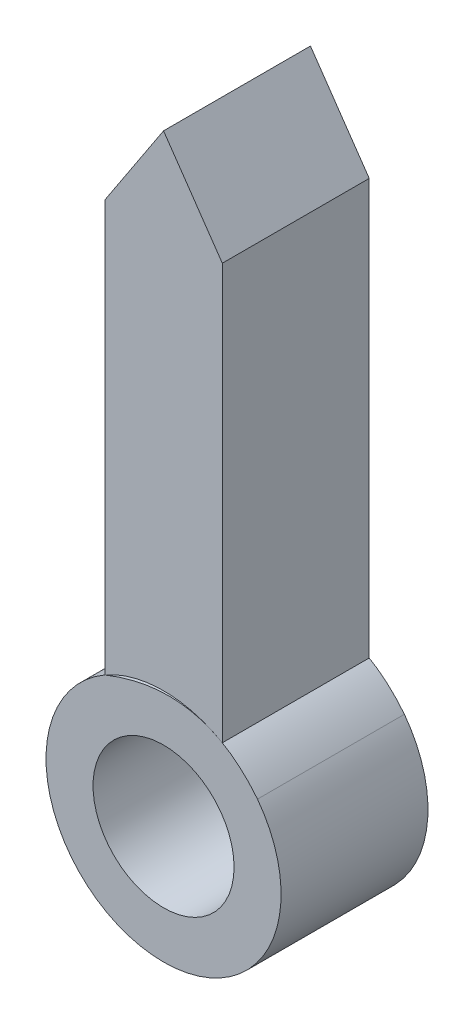
ISO-10303-21;
HEADER;
FILE_DESCRIPTION(('STEP AP214'),'2;1');
FILE_NAME('part.step','',(''),(''),'','','');
FILE_SCHEMA(('AUTOMOTIVE_DESIGN { 1 0 10303 214 1 1 1 1 }'));
ENDSEC;
DATA;
#1=APPLICATION_CONTEXT('core data for automotive mechanical design processes');
#2=APPLICATION_PROTOCOL_DEFINITION('international standard','automotive_design',2000,#1);
#3=PRODUCT_CONTEXT('',#1,'mechanical');
#4=PRODUCT('Part','Part','',(#3));
#5=PRODUCT_RELATED_PRODUCT_CATEGORY('part','',(#4));
#6=PRODUCT_DEFINITION_FORMATION('','',#4);
#7=PRODUCT_DEFINITION_CONTEXT('part definition',#1,'design');
#8=PRODUCT_DEFINITION('design','',#6,#7);
#9=PRODUCT_DEFINITION_SHAPE('','',#8);
#10=(LENGTH_UNIT() NAMED_UNIT(*) SI_UNIT(.MILLI.,.METRE.));
#11=(NAMED_UNIT(*) PLANE_ANGLE_UNIT() SI_UNIT($,.RADIAN.));
#12=(NAMED_UNIT(*) SI_UNIT($,.STERADIAN.) SOLID_ANGLE_UNIT());
#13=UNCERTAINTY_MEASURE_WITH_UNIT(LENGTH_MEASURE(1.E-05),#10,'distance_accuracy_value','');
#14=(GEOMETRIC_REPRESENTATION_CONTEXT(3) GLOBAL_UNCERTAINTY_ASSIGNED_CONTEXT((#13)) GLOBAL_UNIT_ASSIGNED_CONTEXT((#10,
#11,#12)) REPRESENTATION_CONTEXT('',''));
#15=CARTESIAN_POINT('',(0.,0.,0.));
#16=DIRECTION('',(0.,0.,1.));
#17=DIRECTION('',(1.,0.,0.));
#18=AXIS2_PLACEMENT_3D('',#15,#16,#17);
#19=CARTESIAN_POINT('',(-1.27,0.,3.175));
#20=DIRECTION('',(-1.,0.,0.));
#21=DIRECTION('',(0.,0.,1.));
#22=AXIS2_PLACEMENT_3D('',#19,#20,#21);
#23=PLANE('',#22);
#24=DIRECTION('',(0.,1.,0.));
#25=VECTOR('',#24,1.);
#26=CARTESIAN_POINT('',(-1.27,0.,0.));
#27=LINE('',#26,#25);
#28=CARTESIAN_POINT('',(-1.27,2.19970452561247,0.));
#29=VERTEX_POINT('',#28);
#30=CARTESIAN_POINT('',(-1.27,11.0897045256125,0.));
#31=VERTEX_POINT('',#30);
#32=EDGE_CURVE('E118',#29,#31,#27,.T.);
#33=ORIENTED_EDGE('',*,*,#32,.F.);
#34=DIRECTION('',(0.,0.,-1.));
#35=VECTOR('',#34,1.);
#36=CARTESIAN_POINT('',(-1.27,2.19970452561247,3.175));
#37=LINE('',#36,#35);
#38=CARTESIAN_POINT('',(-1.27,2.19970452561247,3.175));
#39=VERTEX_POINT('',#38);
#40=EDGE_CURVE('E12',#39,#29,#37,.T.);
#41=ORIENTED_EDGE('',*,*,#40,.F.);
#42=DIRECTION('',(0.,1.,0.));
#43=VECTOR('',#42,1.);
#44=CARTESIAN_POINT('',(-1.27,0.,3.175));
#45=LINE('',#44,#43);
#46=CARTESIAN_POINT('',(-1.27,11.0897045256125,3.175));
#47=VERTEX_POINT('',#46);
#48=EDGE_CURVE('E129',#39,#47,#45,.T.);
#49=ORIENTED_EDGE('',*,*,#48,.T.);
#50=DIRECTION('',(0.,0.,-1.));
#51=VECTOR('',#50,1.);
#52=CARTESIAN_POINT('',(-1.27,11.0897045256125,3.175));
#53=LINE('',#52,#51);
#54=EDGE_CURVE('E61',#47,#31,#53,.T.);
#55=ORIENTED_EDGE('',*,*,#54,.T.);
#56=EDGE_LOOP('',(#33,#41,#49,#55));
#57=FACE_BOUND('',#56,.T.);
#58=ADVANCED_FACE('F45',(#57),#23,.T.);
#59=CARTESIAN_POINT('',(0.,0.,3.175));
#60=DIRECTION('',(0.,0.,-1.));
#61=DIRECTION('',(-1.,0.,0.));
#62=AXIS2_PLACEMENT_3D('',#59,#60,#61);
#63=CYLINDRICAL_SURFACE('',#62,2.54);
#64=CARTESIAN_POINT('',(0.,0.,0.));
#65=DIRECTION('',(0.,0.,1.));
#66=DIRECTION('',(1.,0.,0.));
#67=AXIS2_PLACEMENT_3D('',#64,#65,#66);
#68=CIRCLE('',#67,2.54);
#69=CARTESIAN_POINT('',(1.27,2.19970452561248,0.));
#70=VERTEX_POINT('',#69);
#71=EDGE_CURVE('E120',#70,#29,#68,.T.);
#72=ORIENTED_EDGE('',*,*,#71,.F.);
#73=DIRECTION('',(0.,0.,-1.));
#74=VECTOR('',#73,1.);
#75=CARTESIAN_POINT('',(1.27,2.19970452561248,3.175));
#76=LINE('',#75,#74);
#77=CARTESIAN_POINT('',(1.27,2.19970452561248,3.175));
#78=VERTEX_POINT('',#77);
#79=EDGE_CURVE('E53',#78,#70,#76,.T.);
#80=ORIENTED_EDGE('',*,*,#79,.F.);
#81=CARTESIAN_POINT('',(0.,0.,3.175));
#82=DIRECTION('',(0.,0.,1.));
#83=DIRECTION('',(1.,0.,0.));
#84=AXIS2_PLACEMENT_3D('',#81,#82,#83);
#85=CIRCLE('',#84,2.54);
#86=EDGE_CURVE('E101',#78,#39,#85,.T.);
#87=ORIENTED_EDGE('',*,*,#86,.T.);
#88=ORIENTED_EDGE('',*,*,#40,.T.);
#89=EDGE_LOOP('',(#72,#80,#87,#88));
#90=FACE_BOUND('',#89,.T.);
#91=ADVANCED_FACE('F135',(#90),#63,.F.);
#92=CARTESIAN_POINT('',(1.27,0.,3.175));
#93=DIRECTION('',(-1.,0.,0.));
#94=DIRECTION('',(0.,-1.,0.));
#95=AXIS2_PLACEMENT_3D('',#92,#93,#94);
#96=PLANE('',#95);
#97=DIRECTION('',(0.,1.,0.));
#98=VECTOR('',#97,1.);
#99=CARTESIAN_POINT('',(1.27,0.,0.));
#100=LINE('',#99,#98);
#101=CARTESIAN_POINT('',(1.27,11.176,0.));
#102=VERTEX_POINT('',#101);
#103=EDGE_CURVE('E108',#70,#102,#100,.T.);
#104=ORIENTED_EDGE('',*,*,#103,.T.);
#105=DIRECTION('',(0.,0.,-1.));
#106=VECTOR('',#105,1.);
#107=CARTESIAN_POINT('',(1.27,11.176,3.175));
#108=LINE('',#107,#106);
#109=CARTESIAN_POINT('',(1.27,11.176,3.175));
#110=VERTEX_POINT('',#109);
#111=EDGE_CURVE('E105',#110,#102,#108,.T.);
#112=ORIENTED_EDGE('',*,*,#111,.F.);
#113=DIRECTION('',(0.,1.,0.));
#114=VECTOR('',#113,1.);
#115=CARTESIAN_POINT('',(1.27,0.,3.175));
#116=LINE('',#115,#114);
#117=EDGE_CURVE('E94',#78,#110,#116,.T.);
#118=ORIENTED_EDGE('',*,*,#117,.F.);
#119=ORIENTED_EDGE('',*,*,#79,.T.);
#120=EDGE_LOOP('',(#104,#112,#118,#119));
#121=FACE_BOUND('',#120,.T.);
#122=ADVANCED_FACE('F106',(#121),#96,.F.);
#123=CARTESIAN_POINT('',(6.08273111645857,4.19114829607112,3.175));
#124=DIRECTION('',(0.823455583886782,0.567380737570178,0.));
#125=DIRECTION('',(-0.567380737570178,0.823455583886782,0.));
#126=AXIS2_PLACEMENT_3D('',#123,#124,#125);
#127=PLANE('',#126);
#128=DIRECTION('',(0.567380737570178,-0.823455583886782,0.));
#129=VECTOR('',#128,1.);
#130=CARTESIAN_POINT('',(6.08273111645857,4.19114829607112,0.));
#131=LINE('',#130,#129);
#132=CARTESIAN_POINT('',(0.,13.0191866333969,0.));
#133=VERTEX_POINT('',#132);
#134=EDGE_CURVE('E124',#133,#102,#131,.T.);
#135=ORIENTED_EDGE('',*,*,#134,.F.);
#136=DIRECTION('',(0.,0.,-1.));
#137=VECTOR('',#136,1.);
#138=CARTESIAN_POINT('',(0.,13.0191866333969,3.175));
#139=LINE('',#138,#137);
#140=CARTESIAN_POINT('',(0.,13.0191866333969,3.175));
#141=VERTEX_POINT('',#140);
#142=EDGE_CURVE('E77',#141,#133,#139,.T.);
#143=ORIENTED_EDGE('',*,*,#142,.F.);
#144=DIRECTION('',(0.567380737570178,-0.823455583886782,0.));
#145=VECTOR('',#144,1.);
#146=CARTESIAN_POINT('',(6.08273111645857,4.19114829607112,3.175));
#147=LINE('',#146,#145);
#148=EDGE_CURVE('E99',#141,#110,#147,.T.);
#149=ORIENTED_EDGE('',*,*,#148,.T.);
#150=ORIENTED_EDGE('',*,*,#111,.T.);
#151=EDGE_LOOP('',(#135,#143,#149,#150));
#152=FACE_BOUND('',#151,.T.);
#153=ADVANCED_FACE('F112',(#152),#127,.T.);
#154=CARTESIAN_POINT('',(-5.9790018623025,3.93542512495413,3.175));
#155=DIRECTION('',(-0.8352970263536,0.54979894303721,0.));
#156=DIRECTION('',(-0.54979894303721,-0.8352970263536,0.));
#157=AXIS2_PLACEMENT_3D('',#154,#155,#156);
#158=PLANE('',#157);
#159=DIRECTION('',(0.54979894303721,0.8352970263536,0.));
#160=VECTOR('',#159,1.);
#161=CARTESIAN_POINT('',(-5.9790018623025,3.93542512495413,0.));
#162=LINE('',#161,#160);
#163=EDGE_CURVE('E126',#31,#133,#162,.T.);
#164=ORIENTED_EDGE('',*,*,#163,.F.);
#165=ORIENTED_EDGE('',*,*,#54,.F.);
#166=DIRECTION('',(0.54979894303721,0.8352970263536,0.));
#167=VECTOR('',#166,1.);
#168=CARTESIAN_POINT('',(-5.9790018623025,3.93542512495413,3.175));
#169=LINE('',#168,#167);
#170=EDGE_CURVE('E113',#47,#141,#169,.T.);
#171=ORIENTED_EDGE('',*,*,#170,.T.);
#172=ORIENTED_EDGE('',*,*,#142,.T.);
#173=EDGE_LOOP('',(#164,#165,#171,#172));
#174=FACE_BOUND('',#173,.T.);
#175=ADVANCED_FACE('F136',(#174),#158,.T.);
#176=CARTESIAN_POINT('',(0.,0.,3.175));
#177=DIRECTION('',(0.,0.,1.));
#178=DIRECTION('',(1.,0.,0.));
#179=AXIS2_PLACEMENT_3D('',#176,#177,#178);
#180=PLANE('',#179);
#181=ORIENTED_EDGE('',*,*,#48,.F.);
#182=ORIENTED_EDGE('',*,*,#86,.F.);
#183=ORIENTED_EDGE('',*,*,#117,.T.);
#184=ORIENTED_EDGE('',*,*,#148,.F.);
#185=ORIENTED_EDGE('',*,*,#170,.F.);
#186=EDGE_LOOP('',(#181,#182,#183,#184,#185));
#187=FACE_BOUND('',#186,.T.);
#188=ADVANCED_FACE('F96',(#187),#180,.T.);
#189=CARTESIAN_POINT('',(0.,0.,0.));
#190=DIRECTION('',(0.,0.,1.));
#191=DIRECTION('',(1.,0.,0.));
#192=AXIS2_PLACEMENT_3D('',#189,#190,#191);
#193=PLANE('',#192);
#194=ORIENTED_EDGE('',*,*,#32,.T.);
#195=ORIENTED_EDGE('',*,*,#163,.T.);
#196=ORIENTED_EDGE('',*,*,#134,.T.);
#197=ORIENTED_EDGE('',*,*,#103,.F.);
#198=ORIENTED_EDGE('',*,*,#71,.T.);
#199=EDGE_LOOP('',(#194,#195,#196,#197,#198));
#200=FACE_BOUND('',#199,.T.);
#201=ADVANCED_FACE('F134',(#200),#193,.F.);
#202=CLOSED_SHELL('',(#58,#91,#122,#153,#175,#188,#201));
#203=MANIFOLD_SOLID_BREP('B2',#202);
#204=CARTESIAN_POINT('',(-1.27,2.19970452561247,3.175));
#205=CARTESIAN_POINT('',(0.827273922653852,3.04181816120253,3.175));
#206=CARTESIAN_POINT('',(2.03041722290463,1.52610808953109,3.175));
#207=B_SPLINE_CURVE_WITH_KNOTS('',2,(#204,#205,#206),.UNSPECIFIED.,.F.,.F.,(3,3),(0.,1.),.UNSPECIFIED.);
#208=DIRECTION('',(0.,0.,-1.));
#209=VECTOR('',#208,1.);
#210=SURFACE_OF_LINEAR_EXTRUSION('',#207,#209);
#211=CARTESIAN_POINT('',(-1.27,2.19970452561247,0.));
#212=CARTESIAN_POINT('',(0.827273922653852,3.04181816120253,0.));
#213=CARTESIAN_POINT('',(2.03041722290463,1.52610808953109,0.));
#214=B_SPLINE_CURVE_WITH_KNOTS('',2,(#211,#212,#213),.UNSPECIFIED.,.F.,.F.,(3,3),(0.,1.),.UNSPECIFIED.);
#215=CARTESIAN_POINT('',(-1.27,2.19970452561247,0.));
#216=VERTEX_POINT('',#215);
#217=CARTESIAN_POINT('',(2.03041722290463,1.52610808953109,0.));
#218=VERTEX_POINT('',#217);
#219=EDGE_CURVE('E227',#216,#218,#214,.T.);
#220=ORIENTED_EDGE('',*,*,#219,.F.);
#221=DIRECTION('',(0.,0.,-1.));
#222=VECTOR('',#221,1.);
#223=CARTESIAN_POINT('',(-1.27,2.19970452561247,3.175));
#224=LINE('',#223,#222);
#225=CARTESIAN_POINT('',(-1.27,2.19970452561247,3.175));
#226=VERTEX_POINT('',#225);
#227=EDGE_CURVE('E43',#226,#216,#224,.T.);
#228=ORIENTED_EDGE('',*,*,#227,.F.);
#229=CARTESIAN_POINT('',(2.03041722290463,1.52610808953109,3.175));
#230=VERTEX_POINT('',#229);
#231=EDGE_CURVE('E228',#226,#230,#207,.T.);
#232=ORIENTED_EDGE('',*,*,#231,.T.);
#233=DIRECTION('',(0.,0.,-1.));
#234=VECTOR('',#233,1.);
#235=CARTESIAN_POINT('',(2.03041722290463,1.52610808953109,3.175));
#236=LINE('',#235,#234);
#237=EDGE_CURVE('E207',#230,#218,#236,.T.);
#238=ORIENTED_EDGE('',*,*,#237,.T.);
#239=EDGE_LOOP('',(#220,#228,#232,#238));
#240=FACE_BOUND('',#239,.T.);
#241=ADVANCED_FACE('F198',(#240),#210,.T.);
#242=CARTESIAN_POINT('',(0.,0.,3.175));
#243=DIRECTION('',(0.,0.,-1.));
#244=DIRECTION('',(-1.,0.,0.));
#245=AXIS2_PLACEMENT_3D('',#242,#243,#244);
#246=CYLINDRICAL_SURFACE('',#245,1.524);
#247=CARTESIAN_POINT('',(0.,0.,3.175));
#248=DIRECTION('',(0.,0.,1.));
#249=DIRECTION('',(1.,0.,0.));
#250=AXIS2_PLACEMENT_3D('',#247,#248,#249);
#251=CIRCLE('',#250,1.524);
#252=CARTESIAN_POINT('',(1.524,0.,3.175));
#253=VERTEX_POINT('',#252);
#254=EDGE_CURVE('E232',#253,#253,#251,.T.);
#255=ORIENTED_EDGE('',*,*,#254,.T.);
#256=EDGE_LOOP('',(#255));
#257=FACE_BOUND('',#256,.T.);
#258=CARTESIAN_POINT('',(0.,0.,0.));
#259=DIRECTION('',(0.,0.,1.));
#260=DIRECTION('',(1.,0.,0.));
#261=AXIS2_PLACEMENT_3D('',#258,#259,#260);
#262=CIRCLE('',#261,1.524);
#263=CARTESIAN_POINT('',(1.524,0.,0.));
#264=VERTEX_POINT('',#263);
#265=EDGE_CURVE('E235',#264,#264,#262,.T.);
#266=ORIENTED_EDGE('',*,*,#265,.F.);
#267=EDGE_LOOP('',(#266));
#268=FACE_BOUND('',#267,.T.);
#269=ADVANCED_FACE('F200',(#257,#268),#246,.F.);
#270=CARTESIAN_POINT('',(0.,0.,3.175));
#271=DIRECTION('',(0.,0.,-1.));
#272=DIRECTION('',(-1.,0.,0.));
#273=AXIS2_PLACEMENT_3D('',#270,#271,#272);
#274=CYLINDRICAL_SURFACE('',#273,2.54);
#275=CARTESIAN_POINT('',(0.,0.,0.));
#276=DIRECTION('',(0.,0.,1.));
#277=DIRECTION('',(1.,0.,0.));
#278=AXIS2_PLACEMENT_3D('',#275,#276,#277);
#279=CIRCLE('',#278,2.54);
#280=EDGE_CURVE('E229',#216,#218,#279,.T.);
#281=ORIENTED_EDGE('',*,*,#280,.T.);
#282=ORIENTED_EDGE('',*,*,#237,.F.);
#283=CARTESIAN_POINT('',(0.,0.,3.175));
#284=DIRECTION('',(0.,0.,1.));
#285=DIRECTION('',(1.,0.,0.));
#286=AXIS2_PLACEMENT_3D('',#283,#284,#285);
#287=CIRCLE('',#286,2.54);
#288=EDGE_CURVE('E214',#226,#230,#287,.T.);
#289=ORIENTED_EDGE('',*,*,#288,.F.);
#290=ORIENTED_EDGE('',*,*,#227,.T.);
#291=EDGE_LOOP('',(#281,#282,#289,#290));
#292=FACE_BOUND('',#291,.T.);
#293=ADVANCED_FACE('F230',(#292),#274,.T.);
#294=CARTESIAN_POINT('',(0.,0.,3.175));
#295=DIRECTION('',(0.,0.,1.));
#296=DIRECTION('',(1.,0.,0.));
#297=AXIS2_PLACEMENT_3D('',#294,#295,#296);
#298=PLANE('',#297);
#299=ORIENTED_EDGE('',*,*,#254,.F.);
#300=EDGE_LOOP('',(#299));
#301=FACE_BOUND('',#300,.T.);
#302=ORIENTED_EDGE('',*,*,#231,.F.);
#303=ORIENTED_EDGE('',*,*,#288,.T.);
#304=EDGE_LOOP('',(#302,#303));
#305=FACE_BOUND('',#304,.T.);
#306=ADVANCED_FACE('F257',(#301,#305),#298,.T.);
#307=CARTESIAN_POINT('',(0.,0.,0.));
#308=DIRECTION('',(0.,0.,1.));
#309=DIRECTION('',(1.,0.,0.));
#310=AXIS2_PLACEMENT_3D('',#307,#308,#309);
#311=PLANE('',#310);
#312=ORIENTED_EDGE('',*,*,#265,.T.);
#313=EDGE_LOOP('',(#312));
#314=FACE_BOUND('',#313,.T.);
#315=ORIENTED_EDGE('',*,*,#219,.T.);
#316=ORIENTED_EDGE('',*,*,#280,.F.);
#317=EDGE_LOOP('',(#315,#316));
#318=FACE_BOUND('',#317,.T.);
#319=ADVANCED_FACE('F234',(#314,#318),#311,.F.);
#320=CLOSED_SHELL('',(#241,#269,#293,#306,#319));
#321=MANIFOLD_SOLID_BREP('B6',#320);
#322=ADVANCED_BREP_SHAPE_REPRESENTATION('',(#18,#203,#321),#14);
#323=SHAPE_DEFINITION_REPRESENTATION(#9,#322);
ENDSEC;
END-ISO-10303-21;
